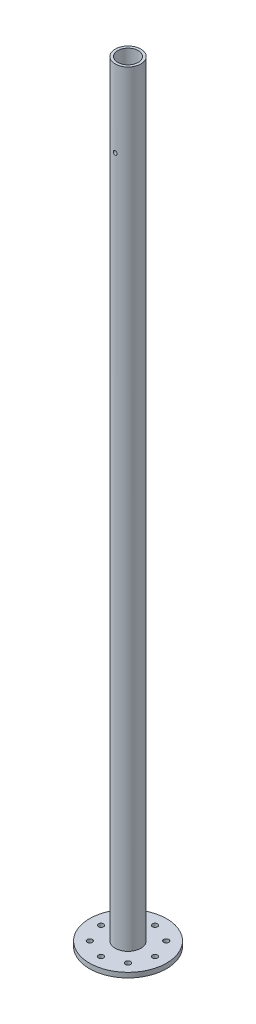
ISO-10303-21;
HEADER;
FILE_DESCRIPTION(('STEP AP214'),'2;1');
FILE_NAME('part.step','',(''),(''),'','','');
FILE_SCHEMA(('AUTOMOTIVE_DESIGN { 1 0 10303 214 1 1 1 1 }'));
ENDSEC;
DATA;
#1=APPLICATION_CONTEXT('core data for automotive mechanical design processes');
#2=APPLICATION_PROTOCOL_DEFINITION('international standard','automotive_design',2000,#1);
#3=PRODUCT_CONTEXT('',#1,'mechanical');
#4=PRODUCT('Part','Part','',(#3));
#5=PRODUCT_RELATED_PRODUCT_CATEGORY('part','',(#4));
#6=PRODUCT_DEFINITION_FORMATION('','',#4);
#7=PRODUCT_DEFINITION_CONTEXT('part definition',#1,'design');
#8=PRODUCT_DEFINITION('design','',#6,#7);
#9=PRODUCT_DEFINITION_SHAPE('','',#8);
#10=(LENGTH_UNIT() NAMED_UNIT(*) SI_UNIT(.MILLI.,.METRE.));
#11=(NAMED_UNIT(*) PLANE_ANGLE_UNIT() SI_UNIT($,.RADIAN.));
#12=(NAMED_UNIT(*) SI_UNIT($,.STERADIAN.) SOLID_ANGLE_UNIT());
#13=UNCERTAINTY_MEASURE_WITH_UNIT(LENGTH_MEASURE(1.E-05),#10,'distance_accuracy_value','');
#14=(GEOMETRIC_REPRESENTATION_CONTEXT(3) GLOBAL_UNCERTAINTY_ASSIGNED_CONTEXT((#13)) GLOBAL_UNIT_ASSIGNED_CONTEXT((#10,
#11,#12)) REPRESENTATION_CONTEXT('',''));
#15=CARTESIAN_POINT('',(0.,0.,0.));
#16=DIRECTION('',(0.,0.,1.));
#17=DIRECTION('',(1.,0.,0.));
#18=AXIS2_PLACEMENT_3D('',#15,#16,#17);
#19=CARTESIAN_POINT('',(0.,1000.,0.));
#20=DIRECTION('',(0.,-1.,0.));
#21=DIRECTION('',(0.,0.,-1.));
#22=AXIS2_PLACEMENT_3D('',#19,#20,#21);
#23=CYLINDRICAL_SURFACE('',#22,16.7);
#24=CARTESIAN_POINT('',(0.,902.5273,-16.7));
#25=CARTESIAN_POINT('',(-0.141095128420646,902.527294192878,-16.6999977248666));
#26=CARTESIAN_POINT('',(-0.282271756014365,902.515444435152,-16.6981931402132));
#27=CARTESIAN_POINT('',(-0.560677885890177,902.46837108286,-16.69116797978));
#28=CARTESIAN_POINT('',(-0.697903426510637,902.433124826175,-16.6859440920921));
#29=CARTESIAN_POINT('',(-0.964338087838373,902.340336635749,-16.6726672871401));
#30=CARTESIAN_POINT('',(-1.09355321925771,902.28281165991,-16.6646165220454));
#31=CARTESIAN_POINT('',(-1.34047716715812,902.147140623926,-16.6465752319658));
#32=CARTESIAN_POINT('',(-1.45818755697505,902.068997388864,-16.6365849727768));
#33=CARTESIAN_POINT('',(-1.67971546997138,901.89364651842,-16.6156866112226));
#34=CARTESIAN_POINT('',(-1.78342833146898,901.796307362856,-16.6047724913657));
#35=CARTESIAN_POINT('',(-1.97311407775401,901.585610774514,-16.5833035171453));
#36=CARTESIAN_POINT('',(-2.05908593485077,901.472252414424,-16.572748683624));
#37=CARTESIAN_POINT('',(-2.21125759341121,901.232030816915,-16.5531349501582));
#38=CARTESIAN_POINT('',(-2.27735595964354,901.105102633903,-16.5440838267946));
#39=CARTESIAN_POINT('',(-2.3872560812604,900.84178608099,-16.5285845646974));
#40=CARTESIAN_POINT('',(-2.43105907382802,900.705398236487,-16.5221362815348));
#41=CARTESIAN_POINT('',(-2.49479963771304,900.428135309495,-16.5126320066065));
#42=CARTESIAN_POINT('',(-2.51491650817754,900.287302335651,-16.5095505416954));
#43=CARTESIAN_POINT('',(-2.53126927126008,900.004228519775,-16.5070514810745));
#44=CARTESIAN_POINT('',(-2.52750655925433,899.86198776049,-16.5076336712833));
#45=CARTESIAN_POINT('',(-2.49635345696991,899.581403677621,-16.5123728504977));
#46=CARTESIAN_POINT('',(-2.4691628934594,899.443037583093,-16.5164996053759));
#47=CARTESIAN_POINT('',(-2.39223879740028,899.172854487514,-16.5278156944145));
#48=CARTESIAN_POINT('',(-2.34250461670411,899.041037674883,-16.5350051166287));
#49=CARTESIAN_POINT('',(-2.22169762525345,898.787087702127,-16.5516698115447));
#50=CARTESIAN_POINT('',(-2.15054030061367,898.664995362663,-16.5611541078411));
#51=CARTESIAN_POINT('',(-1.9889670912896,898.434408196473,-16.5813334053735));
#52=CARTESIAN_POINT('',(-1.89854992036756,898.325914278665,-16.5920284874474));
#53=CARTESIAN_POINT('',(-1.6999273722696,898.12444568949,-16.6135578155045));
#54=CARTESIAN_POINT('',(-1.59155021783407,898.031640318097,-16.6243923695061));
#55=CARTESIAN_POINT('',(-1.36066925029643,897.865509285899,-16.6448787409256));
#56=CARTESIAN_POINT('',(-1.23816537331919,897.792183713179,-16.6545305529951));
#57=CARTESIAN_POINT('',(-0.982360696907692,897.667084502548,-16.671574289205));
#58=CARTESIAN_POINT('',(-0.849053340537452,897.615324071929,-16.6789648277239));
#59=CARTESIAN_POINT('',(-0.575501552772928,897.53497237874,-16.6906417531345));
#60=CARTESIAN_POINT('',(-0.435257599531633,897.50637952154,-16.694928353669));
#61=CARTESIAN_POINT('',(-0.153274658925029,897.473400080201,-16.6998860899833));
#62=CARTESIAN_POINT('',(-0.0115634789844751,897.468780768715,-16.7005919845625));
#63=CARTESIAN_POINT('',(0.270609720172463,897.483261604186,-16.6984034351354));
#64=CARTESIAN_POINT('',(0.411071778631408,897.502361003322,-16.6955091046395));
#65=CARTESIAN_POINT('',(0.68605353346463,897.56354357098,-16.6864668161839));
#66=CARTESIAN_POINT('',(0.820599062456453,897.605513215947,-16.680334933453));
#67=CARTESIAN_POINT('',(1.08074374001703,897.711125095296,-16.6655028210982));
#68=CARTESIAN_POINT('',(1.20634246161494,897.774768363179,-16.6568024690003));
#69=CARTESIAN_POINT('',(1.44605063905851,897.922465889254,-16.6377137747834));
#70=CARTESIAN_POINT('',(1.56006826561348,898.006667602931,-16.6273134260375));
#71=CARTESIAN_POINT('',(1.77243738736242,898.192886734631,-16.6060193301568));
#72=CARTESIAN_POINT('',(1.87078795424147,898.294905207595,-16.5951255538342));
#73=CARTESIAN_POINT('',(2.04987917286142,898.514898586379,-16.573962016272));
#74=CARTESIAN_POINT('',(2.13046372188874,898.633001243808,-16.5636983173964));
#75=CARTESIAN_POINT('',(2.27064995657291,898.881203199563,-16.545064849013));
#76=CARTESIAN_POINT('',(2.33025221708846,899.011302169098,-16.5366950276201));
#77=CARTESIAN_POINT('',(2.42654069356628,899.279340455067,-16.5228409811711));
#78=CARTESIAN_POINT('',(2.46330871639969,899.417249828334,-16.5173464661941));
#79=CARTESIAN_POINT('',(2.51314515855956,899.697375679802,-16.5098378957358));
#80=CARTESIAN_POINT('',(2.52621524641742,899.839591854051,-16.5078235952191));
#81=CARTESIAN_POINT('',(2.52824458805826,900.122738173955,-16.5075127778668));
#82=CARTESIAN_POINT('',(2.51744930794371,900.263666580074,-16.509178411137));
#83=CARTESIAN_POINT('',(2.47258073686001,900.54167888118,-16.5159574733655));
#84=CARTESIAN_POINT('',(2.43850748588383,900.67876278277,-16.5210708964004));
#85=CARTESIAN_POINT('',(2.34813754930704,900.945124675197,-16.5341560629444));
#86=CARTESIAN_POINT('',(2.29185832640577,901.074408707941,-16.5421255599962));
#87=CARTESIAN_POINT('',(2.1586984904794,901.321739279945,-16.5600276032884));
#88=CARTESIAN_POINT('',(2.08181715475708,901.439785424797,-16.5699602183894));
#89=CARTESIAN_POINT('',(1.90874487219507,901.662535925505,-16.5907909042227));
#90=CARTESIAN_POINT('',(1.81237221549701,901.767098318349,-16.6016974764022));
#91=CARTESIAN_POINT('',(1.60343696130598,901.958653797373,-16.6231764534878));
#92=CARTESIAN_POINT('',(1.49087060830547,902.045642796797,-16.6337487801829));
#93=CARTESIAN_POINT('',(1.25199998815004,902.200018841326,-16.6534358590109));
#94=CARTESIAN_POINT('',(1.12562221986845,902.267293224418,-16.6625421046861));
#95=CARTESIAN_POINT('',(0.863282055164747,902.379559582617,-16.6781876404002));
#96=CARTESIAN_POINT('',(0.727329723162268,902.424574568079,-16.6847295797998));
#97=CARTESIAN_POINT('',(0.492311450324202,902.480865866518,-16.6930211238668));
#98=CARTESIAN_POINT('',(0.394694058659713,902.498251957833,-16.6956247197375));
#99=CARTESIAN_POINT('',(0.198064488117486,902.521470989226,-16.6991149454486));
#100=CARTESIAN_POINT('',(0.0990523270562403,902.527304076746,-16.7000015972008));
#101=CARTESIAN_POINT('',(0.,902.5273,-16.7));
#102=B_SPLINE_CURVE_WITH_KNOTS('',3,(#24,#25,#26,#27,#28,#29,#30,#31,#32,#33,#34,#35,#36,#37,
#38,#39,#40,#41,#42,#43,#44,#45,#46,#47,#48,#49,#50,#51,#52,#53,#54,#55,#56,#57,#58,#59,#60,#61,
#62,#63,#64,#65,#66,#67,#68,#69,#70,#71,#72,#73,#74,#75,#76,#77,#78,#79,#80,#81,#82,#83,#84,#85,
#86,#87,#88,#89,#90,#91,#92,#93,#94,#95,#96,#97,#98,#99,#100,#101),.UNSPECIFIED.,.T.,.F.,(4,2,2,
2,2,2,2,2,2,2,2,2,2,2,2,2,2,2,2,2,2,2,2,2,2,2,2,2,2,2,2,2,2,2,2,2,2,2,4),(0.,0.422923428376671,
0.846257104200889,1.26926918228215,1.69222332998482,2.11818285828186,2.54416705439444,
2.97228995926602,3.4003891047612,3.82522635563462,4.25003878185596,4.67126326053055,
5.09249985052391,5.51542048393006,5.93836937026826,6.36562555959309,6.79288368086777,
7.22040308758056,7.64789306551651,8.07122524197053,8.49454407164688,8.9157805182865,
9.33703705425397,9.76140870894243,10.1858054994341,10.6137945302632,11.0417718344224,
11.4682068680737,11.8946118759914,12.3166515399715,12.7386904788637,13.1603981871651,
13.5821206903998,14.0079727425426,14.4339237144431,14.8622633879169,15.2901593404616,
15.5870660079885,15.8839688863248),.UNSPECIFIED.);
#103=CARTESIAN_POINT('',(0.,902.5273,-16.7));
#104=VERTEX_POINT('',#103);
#105=EDGE_CURVE('E11',#104,#104,#102,.T.);
#106=ORIENTED_EDGE('',*,*,#105,.T.);
#107=EDGE_LOOP('',(#106));
#108=FACE_BOUND('',#107,.T.);
#109=CARTESIAN_POINT('',(-2.52729999999999,900.,16.5076574567684));
#110=CARTESIAN_POINT('',(-2.52729418397071,900.141084698879,16.5076598312989));
#111=CARTESIAN_POINT('',(-2.51544611888512,900.28225092481,16.5094857262531));
#112=CARTESIAN_POINT('',(-2.4683800999655,900.560635447681,16.5165869463727));
#113=CARTESIAN_POINT('',(-2.43313944630426,900.697849774679,16.5218656219934));
#114=CARTESIAN_POINT('',(-2.34036764196316,900.964260708767,16.5352611451595));
#115=CARTESIAN_POINT('',(-2.28285371409393,901.093463421504,16.5433757993127));
#116=CARTESIAN_POINT('',(-2.147208706816,901.340366503922,16.5615263596636));
#117=CARTESIAN_POINT('',(-2.06908042601402,901.458068431981,16.5715620050167));
#118=CARTESIAN_POINT('',(-1.8937447606801,901.67960566388,16.592515196488));
#119=CARTESIAN_POINT('',(-1.7964025064424,901.78333368124,16.6034386356662));
#120=CARTESIAN_POINT('',(-1.58569332589265,901.973048746182,16.6248840392995));
#121=CARTESIAN_POINT('',(-1.4723255139482,902.059034812632,16.6354059815257));
#122=CARTESIAN_POINT('',(-1.23209540099089,902.211221518635,16.6549245611477));
#123=CARTESIAN_POINT('',(-1.10516978063726,902.277323281143,16.6639134826598));
#124=CARTESIAN_POINT('',(-0.841858789215738,902.387230385445,16.6792879196453));
#125=CARTESIAN_POINT('',(-0.705473927182084,902.431036925964,16.6856735750824));
#126=CARTESIAN_POINT('',(-0.428221088580409,902.494784625965,16.6950804139815));
#127=CARTESIAN_POINT('',(-0.287395303508082,902.51490548853,16.6981269192171));
#128=CARTESIAN_POINT('',(-0.00433563398410041,902.531268727681,16.700599000508));
#129=CARTESIAN_POINT('',(0.137898170403283,902.527512454294,16.7000247812812));
#130=CARTESIAN_POINT('',(0.418510137841992,902.496369735723,16.6953403307229));
#131=CARTESIAN_POINT('',(0.556910309371945,902.469176628219,16.6912590311961));
#132=CARTESIAN_POINT('',(0.827160237813719,902.392235705713,16.6800512326128));
#133=CARTESIAN_POINT('',(0.959009823587733,902.342487301785,16.6729246540433));
#134=CARTESIAN_POINT('',(1.21300025798632,902.22165047711,16.6563773575607));
#135=CARTESIAN_POINT('',(1.33510185672753,902.150480797099,16.6469479301979));
#136=CARTESIAN_POINT('',(1.56570234024011,901.988881010141,16.6268455869294));
#137=CARTESIAN_POINT('',(1.67420031306794,901.898449613046,16.6161725877509));
#138=CARTESIAN_POINT('',(1.87565354726611,901.699816731284,16.5946470200263));
#139=CARTESIAN_POINT('',(1.9684423587376,901.591446433015,16.5837937234184));
#140=CARTESIAN_POINT('',(2.1345432112959,901.360585167781,16.5632349432301));
#141=CARTESIAN_POINT('',(2.20785512833967,901.238094110894,16.5535294669602));
#142=CARTESIAN_POINT('',(2.33294441107439,900.982293403213,16.5363653587696));
#143=CARTESIAN_POINT('',(2.38470444275879,900.848975146776,16.5289085367472));
#144=CARTESIAN_POINT('',(2.46505202106903,900.575399593958,16.5171178851838));
#145=CARTESIAN_POINT('',(2.49364123152686,900.435142796583,16.5127838314078));
#146=CARTESIAN_POINT('',(2.52660687509589,900.153153106715,16.507772022348));
#147=CARTESIAN_POINT('',(2.53121936349907,900.011448421586,16.5070586227091));
#148=CARTESIAN_POINT('',(2.51672719989738,899.729289831986,16.5092742375732));
#149=CARTESIAN_POINT('',(2.49762329744411,899.588835888126,16.5122031369621));
#150=CARTESIAN_POINT('',(2.43644092922374,899.313898481844,16.521340577945));
#151=CARTESIAN_POINT('',(2.39448026301756,899.179388197247,16.5275322982716));
#152=CARTESIAN_POINT('',(2.28889809267088,898.919310054549,16.5424838372082));
#153=CARTESIAN_POINT('',(2.22527550122819,898.79374264571,16.5512437847251));
#154=CARTESIAN_POINT('',(2.07760910672503,898.554057066453,16.5704286376583));
#155=CARTESIAN_POINT('',(1.99341261551895,898.440033961338,16.5808657822443));
#156=CARTESIAN_POINT('',(1.80720050472751,898.227651367077,16.6021922431804));
#157=CARTESIAN_POINT('',(1.7051838589389,898.129292780621,16.6130815855435));
#158=CARTESIAN_POINT('',(1.4851872579441,897.950182420641,16.6341969889094));
#159=CARTESIAN_POINT('',(1.36707917029705,897.869587160837,16.6444166362926));
#160=CARTESIAN_POINT('',(1.11886332398761,897.729382155878,16.6629412583632));
#161=CARTESIAN_POINT('',(0.988755898495915,897.669771828283,16.6712462861892));
#162=CARTESIAN_POINT('',(0.720721489825479,897.573478386962,16.6849778320981));
#163=CARTESIAN_POINT('',(0.582825720577551,897.536709978682,16.6904150473178));
#164=CARTESIAN_POINT('',(0.302728706936181,897.486868162561,16.6978432684264));
#165=CARTESIAN_POINT('',(0.160527752864404,897.473793160549,16.6998345061717));
#166=CARTESIAN_POINT('',(-0.122625619079805,897.471748750696,16.7001440172964));
#167=CARTESIAN_POINT('',(-0.263576327150627,897.482539967536,16.6984987643425));
#168=CARTESIAN_POINT('',(-0.541634286406634,897.527408226338,16.6917937750858));
#169=CARTESIAN_POINT('',(-0.678741550538446,897.56148518985,16.686734050286));
#170=CARTESIAN_POINT('',(-0.94515293894552,897.651872160497,16.6737660459821));
#171=CARTESIAN_POINT('',(-1.07446289713291,897.70816530154,16.6658599278033));
#172=CARTESIAN_POINT('',(-1.32183956470428,897.841361052705,16.648067107601));
#173=CARTESIAN_POINT('',(-1.43990589578381,897.918264355947,16.638180338971));
#174=CARTESIAN_POINT('',(-1.66265733771455,898.091361685197,16.6174072049218));
#175=CARTESIAN_POINT('',(-1.76720439889943,898.187732343542,16.6065122214569));
#176=CARTESIAN_POINT('',(-1.9587298733613,898.396657175304,16.5850140135869));
#177=CARTESIAN_POINT('',(-2.04570415864795,898.509215140648,16.5744108582387));
#178=CARTESIAN_POINT('',(-2.20006330874633,898.748078076677,16.5546316728963));
#179=CARTESIAN_POINT('',(-2.26733313328547,898.874458084141,16.545464163744));
#180=CARTESIAN_POINT('',(-2.37959035973189,899.13680279878,16.5296942181454));
#181=CARTESIAN_POINT('',(-2.4246008199403,899.272757420147,16.5230891288441));
#182=CARTESIAN_POINT('',(-2.48088014041631,899.507763765008,16.5147132164549));
#183=CARTESIAN_POINT('',(-2.49826085465068,899.605366110876,16.5120813873024));
#184=CARTESIAN_POINT('',(-2.52147274884584,899.801965592405,16.5085526855914));
#185=CARTESIAN_POINT('',(-2.52730408268072,899.900962709464,16.5076557899181));
#186=CARTESIAN_POINT('',(-2.52729999999999,900.,16.5076574567684));
#187=B_SPLINE_CURVE_WITH_KNOTS('',3,(#109,#110,#111,#112,#113,#114,#115,#116,#117,#118,#119,
#120,#121,#122,#123,#124,#125,#126,#127,#128,#129,#130,#131,#132,#133,#134,#135,#136,#137,#138,
#139,#140,#141,#142,#143,#144,#145,#146,#147,#148,#149,#150,#151,#152,#153,#154,#155,#156,#157,
#158,#159,#160,#161,#162,#163,#164,#165,#166,#167,#168,#169,#170,#171,#172,#173,#174,#175,#176,
#177,#178,#179,#180,#181,#182,#183,#184,#185,#186),.UNSPECIFIED.,.T.,.F.,(4,2,2,2,2,2,2,2,2,2,2,
2,2,2,2,2,2,2,2,2,2,2,2,2,2,2,2,2,2,2,2,2,2,2,2,2,2,2,4),(0.,0.422892091179664,0.84619515176581,
1.2691715446907,1.69209054381559,2.11809109243251,2.54411519264734,2.97222400061956,
3.40030978843668,3.82512631959299,4.24991883157979,4.67124027864489,5.09257272719221,
5.51552404064545,5.93850369225841,6.36571727107998,6.79293357064338,7.22049281617131,
7.64802135714254,8.07133271783622,8.49463070020301,8.91576744404732,9.33692532961498,
9.76130917106662,10.1857174594293,10.613727701176,11.0417260624702,11.46811646409,
11.8944781756887,12.3165829420155,12.738686286313,13.1604697924802,13.5822674850162,
14.0080796134272,14.4339916526279,14.8623428700684,15.2902494274923,15.587111137121,
15.8839688915909),.UNSPECIFIED.);
#188=CARTESIAN_POINT('',(-2.52729999999999,900.,16.5076574567684));
#189=VERTEX_POINT('',#188);
#190=EDGE_CURVE('E84',#189,#189,#187,.T.);
#191=ORIENTED_EDGE('',*,*,#190,.T.);
#192=EDGE_LOOP('',(#191));
#193=FACE_BOUND('',#192,.T.);
#194=CARTESIAN_POINT('',(0.,1000.,0.));
#195=DIRECTION('',(0.,1.,0.));
#196=DIRECTION('',(0.,0.,1.));
#197=AXIS2_PLACEMENT_3D('',#194,#195,#196);
#198=CIRCLE('',#197,16.7);
#199=CARTESIAN_POINT('',(0.,1000.,16.7));
#200=VERTEX_POINT('',#199);
#201=EDGE_CURVE('E51',#200,#200,#198,.T.);
#202=ORIENTED_EDGE('',*,*,#201,.F.);
#203=EDGE_LOOP('',(#202));
#204=FACE_BOUND('',#203,.T.);
#205=CARTESIAN_POINT('',(0.,6.34999999999997,0.));
#206=DIRECTION('',(0.,-1.,0.));
#207=DIRECTION('',(0.,0.,-1.));
#208=AXIS2_PLACEMENT_3D('',#205,#206,#207);
#209=CIRCLE('',#208,16.7);
#210=CARTESIAN_POINT('',(0.,6.34999999999997,-16.7));
#211=VERTEX_POINT('',#210);
#212=EDGE_CURVE('E47',#211,#211,#209,.T.);
#213=ORIENTED_EDGE('',*,*,#212,.F.);
#214=EDGE_LOOP('',(#213));
#215=FACE_BOUND('',#214,.T.);
#216=ADVANCED_FACE('F37',(#108,#193,#204,#215),#23,.T.);
#217=CARTESIAN_POINT('',(0.,1000.,0.));
#218=DIRECTION('',(0.,1.,0.));
#219=DIRECTION('',(0.,0.,1.));
#220=AXIS2_PLACEMENT_3D('',#217,#218,#219);
#221=PLANE('',#220);
#222=ORIENTED_EDGE('',*,*,#201,.T.);
#223=EDGE_LOOP('',(#222));
#224=FACE_BOUND('',#223,.T.);
#225=CARTESIAN_POINT('',(0.,1000.,0.));
#226=DIRECTION('',(0.,1.,0.));
#227=DIRECTION('',(0.,0.,1.));
#228=AXIS2_PLACEMENT_3D('',#225,#226,#227);
#229=CIRCLE('',#228,13.32);
#230=CARTESIAN_POINT('',(0.,1000.,13.32));
#231=VERTEX_POINT('',#230);
#232=EDGE_CURVE('E56',#231,#231,#229,.T.);
#233=ORIENTED_EDGE('',*,*,#232,.F.);
#234=EDGE_LOOP('',(#233));
#235=FACE_BOUND('',#234,.T.);
#236=ADVANCED_FACE('F119',(#224,#235),#221,.T.);
#237=CARTESIAN_POINT('',(0.,0.,0.));
#238=DIRECTION('',(0.,1.,0.));
#239=DIRECTION('',(0.,0.,1.));
#240=AXIS2_PLACEMENT_3D('',#237,#238,#239);
#241=PLANE('',#240);
#242=CARTESIAN_POINT('',(35.,0.,0.));
#243=DIRECTION('',(0.,-1.,0.));
#244=DIRECTION('',(0.,0.,-1.));
#245=AXIS2_PLACEMENT_3D('',#242,#243,#244);
#246=CIRCLE('',#245,3.37819999999999);
#247=CARTESIAN_POINT('',(35.,0.,-3.37819999999999));
#248=VERTEX_POINT('',#247);
#249=EDGE_CURVE('E83',#248,#248,#246,.T.);
#250=ORIENTED_EDGE('',*,*,#249,.F.);
#251=EDGE_LOOP('',(#250));
#252=FACE_BOUND('',#251,.T.);
#253=CARTESIAN_POINT('',(0.,0.,-35.));
#254=DIRECTION('',(0.,-1.,0.));
#255=DIRECTION('',(0.,0.,-1.));
#256=AXIS2_PLACEMENT_3D('',#253,#254,#255);
#257=CIRCLE('',#256,3.37819999999999);
#258=CARTESIAN_POINT('',(0.,0.,-38.3782));
#259=VERTEX_POINT('',#258);
#260=EDGE_CURVE('E80',#259,#259,#257,.T.);
#261=ORIENTED_EDGE('',*,*,#260,.F.);
#262=EDGE_LOOP('',(#261));
#263=FACE_BOUND('',#262,.T.);
#264=CARTESIAN_POINT('',(-35.,0.,0.));
#265=DIRECTION('',(0.,-1.,0.));
#266=DIRECTION('',(0.,0.,-1.));
#267=AXIS2_PLACEMENT_3D('',#264,#265,#266);
#268=CIRCLE('',#267,3.37819999999999);
#269=CARTESIAN_POINT('',(-35.,0.,-3.37819999999999));
#270=VERTEX_POINT('',#269);
#271=EDGE_CURVE('E76',#270,#270,#268,.T.);
#272=ORIENTED_EDGE('',*,*,#271,.F.);
#273=EDGE_LOOP('',(#272));
#274=FACE_BOUND('',#273,.T.);
#275=CARTESIAN_POINT('',(0.,0.,35.));
#276=DIRECTION('',(0.,-1.,0.));
#277=DIRECTION('',(0.,0.,-1.));
#278=AXIS2_PLACEMENT_3D('',#275,#276,#277);
#279=CIRCLE('',#278,3.37819999999999);
#280=CARTESIAN_POINT('',(0.,0.,31.6218));
#281=VERTEX_POINT('',#280);
#282=EDGE_CURVE('E72',#281,#281,#279,.T.);
#283=ORIENTED_EDGE('',*,*,#282,.F.);
#284=EDGE_LOOP('',(#283));
#285=FACE_BOUND('',#284,.T.);
#286=CARTESIAN_POINT('',(-24.748737341529,0.,-24.7487373415293));
#287=DIRECTION('',(0.,-1.,0.));
#288=DIRECTION('',(0.,0.,-1.));
#289=AXIS2_PLACEMENT_3D('',#286,#287,#288);
#290=CIRCLE('',#289,3.37819999999999);
#291=CARTESIAN_POINT('',(-24.748737341529,0.,-28.1269373415293));
#292=VERTEX_POINT('',#291);
#293=EDGE_CURVE('E68',#292,#292,#290,.T.);
#294=ORIENTED_EDGE('',*,*,#293,.F.);
#295=EDGE_LOOP('',(#294));
#296=FACE_BOUND('',#295,.T.);
#297=CARTESIAN_POINT('',(-24.7487373415292,0.,24.7487373415292));
#298=DIRECTION('',(0.,-1.,0.));
#299=DIRECTION('',(0.,0.,-1.));
#300=AXIS2_PLACEMENT_3D('',#297,#298,#299);
#301=CIRCLE('',#300,3.37819999999999);
#302=CARTESIAN_POINT('',(-24.7487373415292,0.,21.3705373415292));
#303=VERTEX_POINT('',#302);
#304=EDGE_CURVE('E64',#303,#303,#301,.T.);
#305=ORIENTED_EDGE('',*,*,#304,.F.);
#306=EDGE_LOOP('',(#305));
#307=FACE_BOUND('',#306,.T.);
#308=CARTESIAN_POINT('',(24.748737341529,0.,24.7487373415293));
#309=DIRECTION('',(0.,-1.,0.));
#310=DIRECTION('',(0.,0.,-1.));
#311=AXIS2_PLACEMENT_3D('',#308,#309,#310);
#312=CIRCLE('',#311,3.37819999999999);
#313=CARTESIAN_POINT('',(24.748737341529,0.,21.3705373415293));
#314=VERTEX_POINT('',#313);
#315=EDGE_CURVE('E63',#314,#314,#312,.T.);
#316=ORIENTED_EDGE('',*,*,#315,.F.);
#317=EDGE_LOOP('',(#316));
#318=FACE_BOUND('',#317,.T.);
#319=CARTESIAN_POINT('',(24.7487373415292,0.,-24.7487373415292));
#320=DIRECTION('',(0.,-1.,0.));
#321=DIRECTION('',(0.,0.,-1.));
#322=AXIS2_PLACEMENT_3D('',#319,#320,#321);
#323=CIRCLE('',#322,3.37819999999999);
#324=CARTESIAN_POINT('',(24.7487373415292,0.,-28.1269373415292));
#325=VERTEX_POINT('',#324);
#326=EDGE_CURVE('E154',#325,#325,#323,.T.);
#327=ORIENTED_EDGE('',*,*,#326,.F.);
#328=EDGE_LOOP('',(#327));
#329=FACE_BOUND('',#328,.T.);
#330=CARTESIAN_POINT('',(0.,0.,0.));
#331=DIRECTION('',(0.,1.,0.));
#332=DIRECTION('',(0.,0.,1.));
#333=AXIS2_PLACEMENT_3D('',#330,#331,#332);
#334=CIRCLE('',#333,13.32);
#335=CARTESIAN_POINT('',(0.,0.,13.32));
#336=VERTEX_POINT('',#335);
#337=EDGE_CURVE('E141',#336,#336,#334,.T.);
#338=ORIENTED_EDGE('',*,*,#337,.T.);
#339=EDGE_LOOP('',(#338));
#340=FACE_BOUND('',#339,.T.);
#341=CARTESIAN_POINT('',(0.,0.,0.));
#342=DIRECTION('',(0.,-1.,0.));
#343=DIRECTION('',(0.,0.,-1.));
#344=AXIS2_PLACEMENT_3D('',#341,#342,#343);
#345=CIRCLE('',#344,50.);
#346=CARTESIAN_POINT('',(0.,0.,-50.));
#347=VERTEX_POINT('',#346);
#348=EDGE_CURVE('E146',#347,#347,#345,.T.);
#349=ORIENTED_EDGE('',*,*,#348,.T.);
#350=EDGE_LOOP('',(#349));
#351=FACE_BOUND('',#350,.T.);
#352=ADVANCED_FACE('F116',(#252,#263,#274,#285,#296,#307,#318,#329,#340,#351),#241,.F.);
#353=CARTESIAN_POINT('',(0.,1000.,0.));
#354=DIRECTION('',(0.,-1.,0.));
#355=DIRECTION('',(0.,0.,-1.));
#356=AXIS2_PLACEMENT_3D('',#353,#354,#355);
#357=CYLINDRICAL_SURFACE('',#356,13.32);
#358=CARTESIAN_POINT('',(0.,902.5273,-13.32));
#359=CARTESIAN_POINT('',(-0.140607485202213,902.527294660535,-13.3199974433387));
#360=CARTESIAN_POINT('',(-0.281284091590417,902.515526206857,-13.3177506327601));
#361=CARTESIAN_POINT('',(-0.558670994856157,902.468794875927,-13.3090042489674));
#362=CARTESIAN_POINT('',(-0.695377878908569,902.433812623686,-13.302501123357));
#363=CARTESIAN_POINT('',(-0.960773793200204,902.341765123853,-13.2859693411417));
#364=CARTESIAN_POINT('',(-1.08947001721665,902.284720031364,-13.2759439030442));
#365=CARTESIAN_POINT('',(-1.33545349961137,902.150223834888,-13.2534614037999));
#366=CARTESIAN_POINT('',(-1.45274163768312,902.072774306028,-13.2410045303676));
#367=CARTESIAN_POINT('',(-1.67402764942391,901.898660865034,-13.2148627906464));
#368=CARTESIAN_POINT('',(-1.77786558074568,901.801795454381,-13.2011659503261));
#369=CARTESIAN_POINT('',(-1.96791972209867,901.59203330165,-13.1741765589224));
#370=CARTESIAN_POINT('',(-2.05413464751981,901.479135391916,-13.1608840373715));
#371=CARTESIAN_POINT('',(-2.20716340687767,901.239379150872,-13.1360918275258));
#372=CARTESIAN_POINT('',(-2.27381403184512,901.112414912037,-13.1246075722718));
#373=CARTESIAN_POINT('',(-2.38477728993954,900.848836743774,-13.104901133061));
#374=CARTESIAN_POINT('',(-2.42909189796323,900.712223668691,-13.0966786607189));
#375=CARTESIAN_POINT('',(-2.49361084538841,900.434938805074,-13.0845473914405));
#376=CARTESIAN_POINT('',(-2.51409441400251,900.294334215271,-13.0805886775637));
#377=CARTESIAN_POINT('',(-2.53123664595047,900.011632541325,-13.0772826914881));
#378=CARTESIAN_POINT('',(-2.527897497787,899.869535595476,-13.0779349956925));
#379=CARTESIAN_POINT('',(-2.49771538624806,899.589909270964,-13.0837319133087));
#380=CARTESIAN_POINT('',(-2.47119038850021,899.452344125591,-13.0888157510431));
#381=CARTESIAN_POINT('',(-2.39589047359133,899.183652559863,-13.1028074120169));
#382=CARTESIAN_POINT('',(-2.34711459040886,899.052526419331,-13.1117154012807));
#383=CARTESIAN_POINT('',(-2.2283877996492,898.799507149537,-13.1324149479045));
#384=CARTESIAN_POINT('',(-2.15830891451775,898.6776755499,-13.1442238478137));
#385=CARTESIAN_POINT('',(-1.99905587476536,898.447381116795,-13.1693832408363));
#386=CARTESIAN_POINT('',(-1.90987973725579,898.338919673411,-13.1827338939653));
#387=CARTESIAN_POINT('',(-1.7132513223608,898.136607669216,-13.2097370612061));
#388=CARTESIAN_POINT('',(-1.60552718040093,898.043021321058,-13.223390968524));
#389=CARTESIAN_POINT('',(-1.37576926480981,897.875207903191,-13.2492641969769));
#390=CARTESIAN_POINT('',(-1.25373534111456,897.800981036528,-13.2614835030648));
#391=CARTESIAN_POINT('',(-0.998543231051906,897.673952950714,-13.283136313542));
#392=CARTESIAN_POINT('',(-0.865370801339889,897.621179686425,-13.2925661788565));
#393=CARTESIAN_POINT('',(-0.591832409596606,897.538826515732,-13.3075495879912));
#394=CARTESIAN_POINT('',(-0.451467232153866,897.509244085373,-13.3131035536344));
#395=CARTESIAN_POINT('',(-0.16980045281489,897.474481176752,-13.3196512999124));
#396=CARTESIAN_POINT('',(-0.0285450421754882,897.468938762559,-13.3207127125068));
#397=CARTESIAN_POINT('',(0.25287401379998,897.48144168022,-13.3183427608517));
#398=CARTESIAN_POINT('',(0.393037713760748,897.499485824175,-13.3149116228625));
#399=CARTESIAN_POINT('',(0.667143180634686,897.558348775334,-13.3039842492773));
#400=CARTESIAN_POINT('',(0.801125793192399,897.598983994682,-13.2965207961648));
#401=CARTESIAN_POINT('',(1.06037637948127,897.701676602633,-13.278362264101));
#402=CARTESIAN_POINT('',(1.18564374980587,897.763735472749,-13.2676669616635));
#403=CARTESIAN_POINT('',(1.42544944346522,897.908311671579,-13.2440624145462));
#404=CARTESIAN_POINT('',(1.53985242805422,897.991049589055,-13.231129794166));
#405=CARTESIAN_POINT('',(1.75328035492844,898.174337309949,-13.2045445207434));
#406=CARTESIAN_POINT('',(1.85230382265595,898.274888819323,-13.190891798827));
#407=CARTESIAN_POINT('',(2.03354087514292,898.492589605819,-13.1641800677816));
#408=CARTESIAN_POINT('',(2.11550719895574,898.609946249909,-13.1511316747429));
#409=CARTESIAN_POINT('',(2.2585634631913,898.856975187798,-13.1273215875715));
#410=CARTESIAN_POINT('',(2.31965419072106,898.986647017022,-13.1165598072288));
#411=CARTESIAN_POINT('',(2.41887682308244,899.254004946502,-13.098625176281));
#412=CARTESIAN_POINT('',(2.4571209457527,899.391648170321,-13.0914348134866));
#413=CARTESIAN_POINT('',(2.50990987430227,899.671556230939,-13.0814176273434));
#414=CARTESIAN_POINT('',(2.52445742580912,899.813820530364,-13.0785902984692));
#415=CARTESIAN_POINT('',(2.52934667625195,900.096454641524,-13.0776453673038));
#416=CARTESIAN_POINT('',(2.52007852033423,900.236817598145,-13.0794518537268));
#417=CARTESIAN_POINT('',(2.47845481054164,900.513945813415,-13.0874024582924));
#418=CARTESIAN_POINT('',(2.44609940253451,900.65071109479,-13.0935465490294));
#419=CARTESIAN_POINT('',(2.35938591838989,900.916545123303,-13.1094477627516));
#420=CARTESIAN_POINT('',(2.30507106876355,901.045628422805,-13.1191977843731));
#421=CARTESIAN_POINT('',(2.17602352901913,901.29291222604,-13.1412171252761));
#422=CARTESIAN_POINT('',(2.10128934872767,901.411111934663,-13.1534866284095));
#423=CARTESIAN_POINT('',(1.93217236634404,901.635225588355,-13.1793975217073));
#424=CARTESIAN_POINT('',(1.83750600564249,901.740923498607,-13.1930570542045));
#425=CARTESIAN_POINT('',(1.63180216494701,901.935063712744,-13.2200741650857));
#426=CARTESIAN_POINT('',(1.52076092954875,902.023502047487,-13.2334316733911));
#427=CARTESIAN_POINT('',(1.28422770770796,902.18137865035,-13.2584848237356));
#428=CARTESIAN_POINT('',(1.15861151373333,902.250633535837,-13.2701639445961));
#429=CARTESIAN_POINT('',(0.897344082785078,902.366944595733,-13.2903828629817));
#430=CARTESIAN_POINT('',(0.761702342686739,902.414021474618,-13.2989255868671));
#431=CARTESIAN_POINT('',(0.521398277396506,902.475158295328,-13.3101817972936));
#432=CARTESIAN_POINT('',(0.41813458924944,902.494677767334,-13.3138426994826));
#433=CARTESIAN_POINT('',(0.209926748579155,902.520750441301,-13.3187527233491));
#434=CARTESIAN_POINT('',(0.104982640632615,902.527303986638,-13.3200019088959));
#435=CARTESIAN_POINT('',(0.,902.5273,-13.32));
#436=B_SPLINE_CURVE_WITH_KNOTS('',3,(#358,#359,#360,#361,#362,#363,#364,#365,#366,#367,#368,
#369,#370,#371,#372,#373,#374,#375,#376,#377,#378,#379,#380,#381,#382,#383,#384,#385,#386,#387,
#388,#389,#390,#391,#392,#393,#394,#395,#396,#397,#398,#399,#400,#401,#402,#403,#404,#405,#406,
#407,#408,#409,#410,#411,#412,#413,#414,#415,#416,#417,#418,#419,#420,#421,#422,#423,#424,#425,
#426,#427,#428,#429,#430,#431,#432,#433,#434,#435),.UNSPECIFIED.,.T.,.F.,(4,2,2,2,2,2,2,2,2,2,2,
2,2,2,2,2,2,2,2,2,2,2,2,2,2,2,2,2,2,2,2,2,2,2,2,2,2,2,4),(0.,0.421438504834144,
0.843229199055986,1.2646354807956,1.68600924150191,2.11200636449057,2.53803452901715,
2.96752178780564,3.39697106570281,3.8213361129109,4.24566217581303,4.66425883760155,
5.08287367447979,5.50405477291153,5.92527962425978,6.35330627361991,6.78133741201656,
7.20992451721841,7.63846497103063,8.06053060770282,8.48257498850643,8.9012387006504,
9.31993137051525,9.74329668405729,10.1667025640046,10.5958739525421,11.0250291575372,
11.4520587283822,11.8790388174875,12.2990689386764,12.7190964060936,13.1383010565085,
13.5575363080509,13.9831962244455,14.4089539136984,14.8386512028105,15.2679465453268,
15.5826161291638,15.8972773795099),.UNSPECIFIED.);
#437=CARTESIAN_POINT('',(0.,902.5273,-13.32));
#438=VERTEX_POINT('',#437);
#439=EDGE_CURVE('E106',#438,#438,#436,.T.);
#440=ORIENTED_EDGE('',*,*,#439,.F.);
#441=EDGE_LOOP('',(#440));
#442=FACE_BOUND('',#441,.T.);
#443=CARTESIAN_POINT('',(-2.52729999999999,900.,13.0780409354765));
#444=CARTESIAN_POINT('',(-2.52729464020376,900.140581805314,13.0780436717231));
#445=CARTESIAN_POINT('',(-2.51553033944943,900.28123278825,13.0803323226443));
#446=CARTESIAN_POINT('',(-2.46881699889301,900.558566482327,13.0892278871617));
#447=CARTESIAN_POINT('',(-2.43384848634184,900.69524575981,13.0958384275769));
#448=CARTESIAN_POINT('',(-2.34184115783615,900.960583219092,13.1126027403107));
#449=CARTESIAN_POINT('',(-2.28482314333407,901.089248828534,13.1227531722198));
#450=CARTESIAN_POINT('',(-2.15039076965886,901.335180734329,13.1454496127407));
#451=CARTESIAN_POINT('',(-2.07297792259344,901.452447874902,13.1579954437347));
#452=CARTESIAN_POINT('',(-1.8989020243408,901.673756432167,13.1842476307933));
#453=CARTESIAN_POINT('',(-1.80202924111109,901.777631526071,13.1979656034031));
#454=CARTESIAN_POINT('',(-1.592236588428,901.967757724546,13.2249138665843));
#455=CARTESIAN_POINT('',(-1.47931565409433,902.054007658668,13.23814412472));
#456=CARTESIAN_POINT('',(-1.2395380872381,902.207073972133,13.2627508574668));
#457=CARTESIAN_POINT('',(-1.11257950667705,902.273733317965,13.2741120473777));
#458=CARTESIAN_POINT('',(-0.849013587402865,902.384714244692,13.2935704360741));
#459=CARTESIAN_POINT('',(-0.712407062170128,902.429037706313,13.3016679096593));
#460=CARTESIAN_POINT('',(-0.435146996588192,902.493573769747,13.3136044471981));
#461=CARTESIAN_POINT('',(-0.294560904891557,902.514066838228,13.3174930085217));
#462=CARTESIAN_POINT('',(-0.0118958014935842,902.53123448555,13.3207442508888));
#463=CARTESIAN_POINT('',(0.13018307908314,902.527911139216,13.3201073261808));
#464=CARTESIAN_POINT('',(0.409876581463283,902.497754978558,13.3144179844287));
#465=CARTESIAN_POINT('',(0.54752508668876,902.471224177395,13.309422292873));
#466=CARTESIAN_POINT('',(0.81638033488597,902.395884118214,13.2956404209076));
#467=CARTESIAN_POINT('',(0.947586838760124,902.34707403398,13.2868540999253));
#468=CARTESIAN_POINT('',(1.20070710937946,902.228274579637,13.2663836280957));
#469=CARTESIAN_POINT('',(1.3225630309053,902.158164901245,13.2546830860748));
#470=CARTESIAN_POINT('',(1.55289324278074,901.998845127492,13.2296774164503));
#471=CARTESIAN_POINT('',(1.66136613904293,901.90963304491,13.2163721219673));
#472=CARTESIAN_POINT('',(1.86364107142078,901.712977903891,13.1893834497828));
#473=CARTESIAN_POINT('',(1.95718603520244,901.605270607018,13.1756974158019));
#474=CARTESIAN_POINT('',(2.12492381057631,901.375561553134,13.1496891762246));
#475=CARTESIAN_POINT('',(2.19911632537356,901.253559576938,13.1373669915462));
#476=CARTESIAN_POINT('',(2.32611911867685,900.99837856354,13.1154775069561));
#477=CARTESIAN_POINT('',(2.37889129533273,900.865180113816,13.1059151247495));
#478=CARTESIAN_POINT('',(2.46123443629007,900.591584816897,13.0907026520649));
#479=CARTESIAN_POINT('',(2.49080809772495,900.451188808536,13.0850521067933));
#480=CARTESIAN_POINT('',(2.52553783478449,900.169503925101,13.0783932596156));
#481=CARTESIAN_POINT('',(2.53106357678254,900.028262240697,13.0773146838359));
#482=CARTESIAN_POINT('',(2.51853221830523,899.746874542184,13.0797337422848));
#483=CARTESIAN_POINT('',(2.50047631370304,899.606728472878,13.0832311444563));
#484=CARTESIAN_POINT('',(2.44161178831508,899.332730290239,13.0943425685129));
#485=CARTESIAN_POINT('',(2.400997609915,899.198834847995,13.1019213935725));
#486=CARTESIAN_POINT('',(2.29837601458977,898.939749374195,13.1203113023581));
#487=CARTESIAN_POINT('',(2.23636698807801,898.81455999847,13.131122629265));
#488=CARTESIAN_POINT('',(2.09186754034995,898.574813690962,13.1549190304099));
#489=CARTESIAN_POINT('',(2.00914398239171,898.46039971799,13.1679282586191));
#490=CARTESIAN_POINT('',(1.82587743384602,898.246943012019,13.1945869996332));
#491=CARTESIAN_POINT('',(1.72533280082318,898.147901697384,13.2082365713684));
#492=CARTESIAN_POINT('',(1.50762567234354,897.966617083837,13.2348642509249));
#493=CARTESIAN_POINT('',(1.39025429287278,897.884622634221,13.247830590975));
#494=CARTESIAN_POINT('',(1.14318751382665,897.741517083113,13.2714317030569));
#495=CARTESIAN_POINT('',(1.01349259687112,897.68040516424,13.2820665663412));
#496=CARTESIAN_POINT('',(0.74614203386249,897.581170231264,13.2997559191837));
#497=CARTESIAN_POINT('',(0.60853271584208,897.542925913726,13.3068292689633));
#498=CARTESIAN_POINT('',(0.328696890304542,897.490125140854,13.3166791525477));
#499=CARTESIAN_POINT('',(0.186470882504469,897.475566130453,13.3194561498227));
#500=CARTESIAN_POINT('',(-0.0961762556868098,897.470639954272,13.3203909158508));
#501=CARTESIAN_POINT('',(-0.236590741147022,897.47989724216,13.318620392724));
#502=CARTESIAN_POINT('',(-0.51382490482995,897.521517206078,13.3108083724405));
#503=CARTESIAN_POINT('',(-0.650644619299424,897.55387964904,13.3047669183654));
#504=CARTESIAN_POINT('',(-0.916600725469643,897.640631484532,13.2890921853798));
#505=CARTESIAN_POINT('',(-1.04575086864097,897.694979999197,13.2794655748366));
#506=CARTESIAN_POINT('',(-1.29315456281324,897.824115790351,13.2576616508358));
#507=CARTESIAN_POINT('',(-1.41140735965926,897.89890447999,13.2454841610343));
#508=CARTESIAN_POINT('',(-1.63552847834085,898.068085810266,13.2196964583874));
#509=CARTESIAN_POINT('',(-1.74119024738477,898.162749312321,13.2060678873327));
#510=CARTESIAN_POINT('',(-1.93525886933302,898.368432005068,13.1790286996476));
#511=CARTESIAN_POINT('',(-2.0236616540275,898.47945504116,13.1656181350859));
#512=CARTESIAN_POINT('',(-2.18149457528972,898.715969389334,13.1403937638021));
#513=CARTESIAN_POINT('',(-2.25073623886851,898.841588282471,13.1285963593989));
#514=CARTESIAN_POINT('',(-2.3670218592393,899.102860364758,13.10813190632));
#515=CARTESIAN_POINT('',(-2.41408662732321,899.238504007587,13.0994619246004));
#516=CARTESIAN_POINT('',(-2.47519353662223,899.478776809486,13.0880283581941));
#517=CARTESIAN_POINT('',(-2.49469971668925,899.582005369164,13.0843054843108));
#518=CARTESIAN_POINT('',(-2.52075476495479,899.790143133588,13.0793107864271));
#519=CARTESIAN_POINT('',(-2.52730400121718,899.89505229051,13.0780388928025));
#520=CARTESIAN_POINT('',(-2.52729999999999,900.,13.0780409354765));
#521=B_SPLINE_CURVE_WITH_KNOTS('',3,(#443,#444,#445,#446,#447,#448,#449,#450,#451,#452,#453,
#454,#455,#456,#457,#458,#459,#460,#461,#462,#463,#464,#465,#466,#467,#468,#469,#470,#471,#472,
#473,#474,#475,#476,#477,#478,#479,#480,#481,#482,#483,#484,#485,#486,#487,#488,#489,#490,#491,
#492,#493,#494,#495,#496,#497,#498,#499,#500,#501,#502,#503,#504,#505,#506,#507,#508,#509,#510,
#511,#512,#513,#514,#515,#516,#517,#518,#519,#520),.UNSPECIFIED.,.T.,.F.,(4,2,2,2,2,2,2,2,2,2,2,
2,2,2,2,2,2,2,2,2,2,2,2,2,2,2,2,2,2,2,2,2,2,2,2,2,2,2,4),(0.,0.421361322727138,
0.843076695723033,1.2643951901072,1.68568245600533,2.11178059634893,2.53790702378611,
2.96736142763199,3.39677966453893,3.82109110086787,4.24536557275339,4.66419948682951,
5.08304893436872,5.50430963413293,5.9256141789369,6.35353325975855,6.78145890288941,
7.21014242624094,7.63877610208789,8.06079698030967,8.48279645782691,8.90121370232277,
9.31966243223491,9.74305084671161,10.166478302045,10.5957094785001,11.024923852136,
11.4518407379743,11.8787115668117,12.2988926989204,12.7190695926357,13.138468831893,
13.5578970740686,13.9834630724408,14.4091292625141,14.8388445262324,15.2681557285091,
15.5827210580168,15.8972774516367),.UNSPECIFIED.);
#522=CARTESIAN_POINT('',(-2.52729999999999,900.,13.0780409354765));
#523=VERTEX_POINT('',#522);
#524=EDGE_CURVE('E88',#523,#523,#521,.T.);
#525=ORIENTED_EDGE('',*,*,#524,.F.);
#526=EDGE_LOOP('',(#525));
#527=FACE_BOUND('',#526,.T.);
#528=ORIENTED_EDGE('',*,*,#232,.T.);
#529=EDGE_LOOP('',(#528));
#530=FACE_BOUND('',#529,.T.);
#531=ORIENTED_EDGE('',*,*,#337,.F.);
#532=EDGE_LOOP('',(#531));
#533=FACE_BOUND('',#532,.T.);
#534=ADVANCED_FACE('F110',(#442,#527,#530,#533),#357,.F.);
#535=CARTESIAN_POINT('',(0.,6.35,0.));
#536=DIRECTION('',(0.,-1.,0.));
#537=DIRECTION('',(0.,0.,-1.));
#538=AXIS2_PLACEMENT_3D('',#535,#536,#537);
#539=CYLINDRICAL_SURFACE('',#538,50.);
#540=CARTESIAN_POINT('',(0.,6.35,0.));
#541=DIRECTION('',(0.,-1.,0.));
#542=DIRECTION('',(0.,0.,-1.));
#543=AXIS2_PLACEMENT_3D('',#540,#541,#542);
#544=CIRCLE('',#543,50.);
#545=CARTESIAN_POINT('',(0.,6.35,-50.));
#546=VERTEX_POINT('',#545);
#547=EDGE_CURVE('E144',#546,#546,#544,.T.);
#548=ORIENTED_EDGE('',*,*,#547,.T.);
#549=EDGE_LOOP('',(#548));
#550=FACE_BOUND('',#549,.T.);
#551=ORIENTED_EDGE('',*,*,#348,.F.);
#552=EDGE_LOOP('',(#551));
#553=FACE_BOUND('',#552,.T.);
#554=ADVANCED_FACE('F115',(#550,#553),#539,.T.);
#555=CARTESIAN_POINT('',(0.,6.35,0.));
#556=DIRECTION('',(0.,-1.,0.));
#557=DIRECTION('',(0.,0.,-1.));
#558=AXIS2_PLACEMENT_3D('',#555,#556,#557);
#559=PLANE('',#558);
#560=CARTESIAN_POINT('',(35.,6.35,0.));
#561=DIRECTION('',(0.,-1.,0.));
#562=DIRECTION('',(0.,0.,-1.));
#563=AXIS2_PLACEMENT_3D('',#560,#561,#562);
#564=CIRCLE('',#563,3.37819999999999);
#565=CARTESIAN_POINT('',(35.,6.35,-3.37819999999999));
#566=VERTEX_POINT('',#565);
#567=EDGE_CURVE('E81',#566,#566,#564,.T.);
#568=ORIENTED_EDGE('',*,*,#567,.T.);
#569=EDGE_LOOP('',(#568));
#570=FACE_BOUND('',#569,.T.);
#571=CARTESIAN_POINT('',(0.,6.35,-35.));
#572=DIRECTION('',(0.,-1.,0.));
#573=DIRECTION('',(0.,0.,-1.));
#574=AXIS2_PLACEMENT_3D('',#571,#572,#573);
#575=CIRCLE('',#574,3.37819999999999);
#576=CARTESIAN_POINT('',(0.,6.35,-38.3782));
#577=VERTEX_POINT('',#576);
#578=EDGE_CURVE('E77',#577,#577,#575,.T.);
#579=ORIENTED_EDGE('',*,*,#578,.T.);
#580=EDGE_LOOP('',(#579));
#581=FACE_BOUND('',#580,.T.);
#582=CARTESIAN_POINT('',(-35.,6.35,0.));
#583=DIRECTION('',(0.,-1.,0.));
#584=DIRECTION('',(0.,0.,-1.));
#585=AXIS2_PLACEMENT_3D('',#582,#583,#584);
#586=CIRCLE('',#585,3.37819999999999);
#587=CARTESIAN_POINT('',(-35.,6.35,-3.37819999999999));
#588=VERTEX_POINT('',#587);
#589=EDGE_CURVE('E73',#588,#588,#586,.T.);
#590=ORIENTED_EDGE('',*,*,#589,.T.);
#591=EDGE_LOOP('',(#590));
#592=FACE_BOUND('',#591,.T.);
#593=CARTESIAN_POINT('',(0.,6.35,35.));
#594=DIRECTION('',(0.,-1.,0.));
#595=DIRECTION('',(0.,0.,-1.));
#596=AXIS2_PLACEMENT_3D('',#593,#594,#595);
#597=CIRCLE('',#596,3.37819999999999);
#598=CARTESIAN_POINT('',(0.,6.35,31.6218));
#599=VERTEX_POINT('',#598);
#600=EDGE_CURVE('E69',#599,#599,#597,.T.);
#601=ORIENTED_EDGE('',*,*,#600,.T.);
#602=EDGE_LOOP('',(#601));
#603=FACE_BOUND('',#602,.T.);
#604=CARTESIAN_POINT('',(-24.748737341529,6.35,-24.7487373415293));
#605=DIRECTION('',(0.,-1.,0.));
#606=DIRECTION('',(0.,0.,-1.));
#607=AXIS2_PLACEMENT_3D('',#604,#605,#606);
#608=CIRCLE('',#607,3.37819999999999);
#609=CARTESIAN_POINT('',(-24.748737341529,6.35,-28.1269373415293));
#610=VERTEX_POINT('',#609);
#611=EDGE_CURVE('E65',#610,#610,#608,.T.);
#612=ORIENTED_EDGE('',*,*,#611,.T.);
#613=EDGE_LOOP('',(#612));
#614=FACE_BOUND('',#613,.T.);
#615=CARTESIAN_POINT('',(-24.7487373415292,6.35,24.7487373415292));
#616=DIRECTION('',(0.,-1.,0.));
#617=DIRECTION('',(0.,0.,-1.));
#618=AXIS2_PLACEMENT_3D('',#615,#616,#617);
#619=CIRCLE('',#618,3.37819999999999);
#620=CARTESIAN_POINT('',(-24.7487373415292,6.35,21.3705373415292));
#621=VERTEX_POINT('',#620);
#622=EDGE_CURVE('E60',#621,#621,#619,.T.);
#623=ORIENTED_EDGE('',*,*,#622,.T.);
#624=EDGE_LOOP('',(#623));
#625=FACE_BOUND('',#624,.T.);
#626=CARTESIAN_POINT('',(24.748737341529,6.35,24.7487373415293));
#627=DIRECTION('',(0.,-1.,0.));
#628=DIRECTION('',(0.,0.,-1.));
#629=AXIS2_PLACEMENT_3D('',#626,#627,#628);
#630=CIRCLE('',#629,3.37819999999999);
#631=CARTESIAN_POINT('',(24.748737341529,6.35,21.3705373415293));
#632=VERTEX_POINT('',#631);
#633=EDGE_CURVE('E157',#632,#632,#630,.T.);
#634=ORIENTED_EDGE('',*,*,#633,.T.);
#635=EDGE_LOOP('',(#634));
#636=FACE_BOUND('',#635,.T.);
#637=CARTESIAN_POINT('',(24.7487373415292,6.35,-24.7487373415292));
#638=DIRECTION('',(0.,-1.,0.));
#639=DIRECTION('',(0.,0.,-1.));
#640=AXIS2_PLACEMENT_3D('',#637,#638,#639);
#641=CIRCLE('',#640,3.37819999999999);
#642=CARTESIAN_POINT('',(24.7487373415292,6.35,-28.1269373415292));
#643=VERTEX_POINT('',#642);
#644=EDGE_CURVE('E149',#643,#643,#641,.T.);
#645=ORIENTED_EDGE('',*,*,#644,.T.);
#646=EDGE_LOOP('',(#645));
#647=FACE_BOUND('',#646,.T.);
#648=ORIENTED_EDGE('',*,*,#212,.T.);
#649=EDGE_LOOP('',(#648));
#650=FACE_BOUND('',#649,.T.);
#651=ORIENTED_EDGE('',*,*,#547,.F.);
#652=EDGE_LOOP('',(#651));
#653=FACE_BOUND('',#652,.T.);
#654=ADVANCED_FACE('F185',(#570,#581,#592,#603,#614,#625,#636,#647,#650,#653),#559,.F.);
#655=CARTESIAN_POINT('',(24.7487373415292,0.,-24.7487373415292));
#656=DIRECTION('',(0.,-1.,0.));
#657=DIRECTION('',(0.,0.,-1.));
#658=AXIS2_PLACEMENT_3D('',#655,#656,#657);
#659=CYLINDRICAL_SURFACE('',#658,3.37819999999999);
#660=ORIENTED_EDGE('',*,*,#326,.T.);
#661=EDGE_LOOP('',(#660));
#662=FACE_BOUND('',#661,.T.);
#663=ORIENTED_EDGE('',*,*,#644,.F.);
#664=EDGE_LOOP('',(#663));
#665=FACE_BOUND('',#664,.T.);
#666=ADVANCED_FACE('F190',(#662,#665),#659,.F.);
#667=CARTESIAN_POINT('',(24.748737341529,0.,24.7487373415293));
#668=DIRECTION('',(0.,-1.,0.));
#669=DIRECTION('',(0.,0.,-1.));
#670=AXIS2_PLACEMENT_3D('',#667,#668,#669);
#671=CYLINDRICAL_SURFACE('',#670,3.37819999999999);
#672=ORIENTED_EDGE('',*,*,#315,.T.);
#673=EDGE_LOOP('',(#672));
#674=FACE_BOUND('',#673,.T.);
#675=ORIENTED_EDGE('',*,*,#633,.F.);
#676=EDGE_LOOP('',(#675));
#677=FACE_BOUND('',#676,.T.);
#678=ADVANCED_FACE('F197',(#674,#677),#671,.F.);
#679=CARTESIAN_POINT('',(-24.7487373415292,0.,24.7487373415292));
#680=DIRECTION('',(0.,-1.,0.));
#681=DIRECTION('',(0.,0.,-1.));
#682=AXIS2_PLACEMENT_3D('',#679,#680,#681);
#683=CYLINDRICAL_SURFACE('',#682,3.37819999999999);
#684=ORIENTED_EDGE('',*,*,#304,.T.);
#685=EDGE_LOOP('',(#684));
#686=FACE_BOUND('',#685,.T.);
#687=ORIENTED_EDGE('',*,*,#622,.F.);
#688=EDGE_LOOP('',(#687));
#689=FACE_BOUND('',#688,.T.);
#690=ADVANCED_FACE('F204',(#686,#689),#683,.F.);
#691=CARTESIAN_POINT('',(-24.748737341529,0.,-24.7487373415293));
#692=DIRECTION('',(0.,-1.,0.));
#693=DIRECTION('',(0.,0.,-1.));
#694=AXIS2_PLACEMENT_3D('',#691,#692,#693);
#695=CYLINDRICAL_SURFACE('',#694,3.37819999999999);
#696=ORIENTED_EDGE('',*,*,#293,.T.);
#697=EDGE_LOOP('',(#696));
#698=FACE_BOUND('',#697,.T.);
#699=ORIENTED_EDGE('',*,*,#611,.F.);
#700=EDGE_LOOP('',(#699));
#701=FACE_BOUND('',#700,.T.);
#702=ADVANCED_FACE('F208',(#698,#701),#695,.F.);
#703=CARTESIAN_POINT('',(0.,0.,35.));
#704=DIRECTION('',(0.,-1.,0.));
#705=DIRECTION('',(0.,0.,-1.));
#706=AXIS2_PLACEMENT_3D('',#703,#704,#705);
#707=CYLINDRICAL_SURFACE('',#706,3.37819999999999);
#708=ORIENTED_EDGE('',*,*,#282,.T.);
#709=EDGE_LOOP('',(#708));
#710=FACE_BOUND('',#709,.T.);
#711=ORIENTED_EDGE('',*,*,#600,.F.);
#712=EDGE_LOOP('',(#711));
#713=FACE_BOUND('',#712,.T.);
#714=ADVANCED_FACE('F212',(#710,#713),#707,.F.);
#715=CARTESIAN_POINT('',(-35.,0.,0.));
#716=DIRECTION('',(0.,-1.,0.));
#717=DIRECTION('',(0.,0.,-1.));
#718=AXIS2_PLACEMENT_3D('',#715,#716,#717);
#719=CYLINDRICAL_SURFACE('',#718,3.37819999999999);
#720=ORIENTED_EDGE('',*,*,#271,.T.);
#721=EDGE_LOOP('',(#720));
#722=FACE_BOUND('',#721,.T.);
#723=ORIENTED_EDGE('',*,*,#589,.F.);
#724=EDGE_LOOP('',(#723));
#725=FACE_BOUND('',#724,.T.);
#726=ADVANCED_FACE('F216',(#722,#725),#719,.F.);
#727=CARTESIAN_POINT('',(0.,0.,-35.));
#728=DIRECTION('',(0.,-1.,0.));
#729=DIRECTION('',(0.,0.,-1.));
#730=AXIS2_PLACEMENT_3D('',#727,#728,#729);
#731=CYLINDRICAL_SURFACE('',#730,3.37819999999999);
#732=ORIENTED_EDGE('',*,*,#260,.T.);
#733=EDGE_LOOP('',(#732));
#734=FACE_BOUND('',#733,.T.);
#735=ORIENTED_EDGE('',*,*,#578,.F.);
#736=EDGE_LOOP('',(#735));
#737=FACE_BOUND('',#736,.T.);
#738=ADVANCED_FACE('F219',(#734,#737),#731,.F.);
#739=CARTESIAN_POINT('',(35.,0.,0.));
#740=DIRECTION('',(0.,-1.,0.));
#741=DIRECTION('',(0.,0.,-1.));
#742=AXIS2_PLACEMENT_3D('',#739,#740,#741);
#743=CYLINDRICAL_SURFACE('',#742,3.37819999999999);
#744=ORIENTED_EDGE('',*,*,#249,.T.);
#745=EDGE_LOOP('',(#744));
#746=FACE_BOUND('',#745,.T.);
#747=ORIENTED_EDGE('',*,*,#567,.F.);
#748=EDGE_LOOP('',(#747));
#749=FACE_BOUND('',#748,.T.);
#750=ADVANCED_FACE('F95',(#746,#749),#743,.F.);
#751=CARTESIAN_POINT('',(0.,900.,-16.7));
#752=DIRECTION('',(0.,0.,-1.));
#753=DIRECTION('',(-1.,0.,0.));
#754=AXIS2_PLACEMENT_3D('',#751,#752,#753);
#755=CYLINDRICAL_SURFACE('',#754,2.52729999999999);
#756=ORIENTED_EDGE('',*,*,#524,.T.);
#757=EDGE_LOOP('',(#756));
#758=FACE_BOUND('',#757,.T.);
#759=ORIENTED_EDGE('',*,*,#190,.F.);
#760=EDGE_LOOP('',(#759));
#761=FACE_BOUND('',#760,.T.);
#762=ADVANCED_FACE('F93',(#758,#761),#755,.F.);
#763=ORIENTED_EDGE('',*,*,#439,.T.);
#764=EDGE_LOOP('',(#763));
#765=FACE_BOUND('',#764,.T.);
#766=ORIENTED_EDGE('',*,*,#105,.F.);
#767=EDGE_LOOP('',(#766));
#768=FACE_BOUND('',#767,.T.);
#769=ADVANCED_FACE('F89',(#765,#768),#755,.F.);
#770=CLOSED_SHELL('',(#216,#236,#352,#534,#554,#654,#666,#678,#690,#702,#714,#726,#738,#750,
#762,#769));
#771=MANIFOLD_SOLID_BREP('B2',#770);
#772=ADVANCED_BREP_SHAPE_REPRESENTATION('',(#18,#771),#14);
#773=SHAPE_DEFINITION_REPRESENTATION(#9,#772);
ENDSEC;
END-ISO-10303-21;
